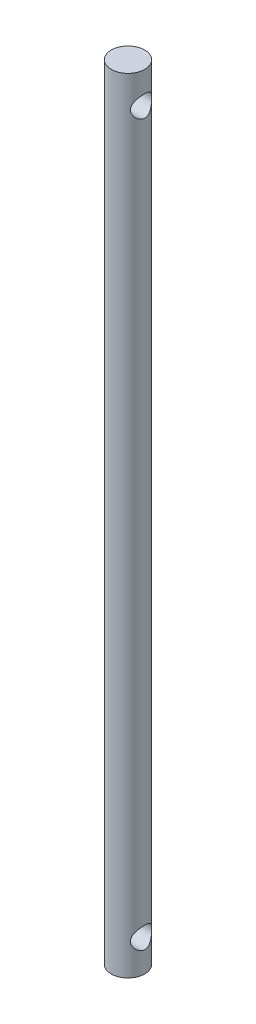
ISO-10303-21;
HEADER;
FILE_DESCRIPTION(('STEP AP214'),'2;1');
FILE_NAME('part.step','',(''),(''),'','','');
FILE_SCHEMA(('AUTOMOTIVE_DESIGN { 1 0 10303 214 1 1 1 1 }'));
ENDSEC;
DATA;
#1=APPLICATION_CONTEXT('core data for automotive mechanical design processes');
#2=APPLICATION_PROTOCOL_DEFINITION('international standard','automotive_design',2000,#1);
#3=PRODUCT_CONTEXT('',#1,'mechanical');
#4=PRODUCT('Part','Part','',(#3));
#5=PRODUCT_RELATED_PRODUCT_CATEGORY('part','',(#4));
#6=PRODUCT_DEFINITION_FORMATION('','',#4);
#7=PRODUCT_DEFINITION_CONTEXT('part definition',#1,'design');
#8=PRODUCT_DEFINITION('design','',#6,#7);
#9=PRODUCT_DEFINITION_SHAPE('','',#8);
#10=(LENGTH_UNIT() NAMED_UNIT(*) SI_UNIT(.MILLI.,.METRE.));
#11=(NAMED_UNIT(*) PLANE_ANGLE_UNIT() SI_UNIT($,.RADIAN.));
#12=(NAMED_UNIT(*) SI_UNIT($,.STERADIAN.) SOLID_ANGLE_UNIT());
#13=UNCERTAINTY_MEASURE_WITH_UNIT(LENGTH_MEASURE(1.E-05),#10,'distance_accuracy_value','');
#14=(GEOMETRIC_REPRESENTATION_CONTEXT(3) GLOBAL_UNCERTAINTY_ASSIGNED_CONTEXT((#13)) GLOBAL_UNIT_ASSIGNED_CONTEXT((#10,
#11,#12)) REPRESENTATION_CONTEXT('',''));
#15=CARTESIAN_POINT('',(0.,0.,0.));
#16=DIRECTION('',(0.,0.,1.));
#17=DIRECTION('',(1.,0.,0.));
#18=AXIS2_PLACEMENT_3D('',#15,#16,#17);
#19=CARTESIAN_POINT('',(0.,74.2,0.));
#20=DIRECTION('',(0.,-1.,0.));
#21=DIRECTION('',(0.,0.,-1.));
#22=AXIS2_PLACEMENT_3D('',#19,#20,#21);
#23=CYLINDRICAL_SURFACE('',#22,1.5875);
#24=CARTESIAN_POINT('',(0.,74.2,0.));
#25=DIRECTION('',(0.,1.,0.));
#26=DIRECTION('',(0.,0.,1.));
#27=AXIS2_PLACEMENT_3D('',#24,#25,#26);
#28=CIRCLE('',#27,1.5875);
#29=CARTESIAN_POINT('',(0.,74.2,1.5875));
#30=VERTEX_POINT('',#29);
#31=EDGE_CURVE('E10',#30,#30,#28,.T.);
#32=ORIENTED_EDGE('',*,*,#31,.F.);
#33=EDGE_LOOP('',(#32));
#34=FACE_BOUND('',#33,.T.);
#35=CARTESIAN_POINT('',(0.,0.,0.));
#36=DIRECTION('',(0.,1.,0.));
#37=DIRECTION('',(0.,0.,1.));
#38=AXIS2_PLACEMENT_3D('',#35,#36,#37);
#39=CIRCLE('',#38,1.5875);
#40=CARTESIAN_POINT('',(0.,0.,1.5875));
#41=VERTEX_POINT('',#40);
#42=EDGE_CURVE('E46',#41,#41,#39,.T.);
#43=ORIENTED_EDGE('',*,*,#42,.T.);
#44=EDGE_LOOP('',(#43));
#45=FACE_BOUND('',#44,.T.);
#46=CARTESIAN_POINT('',(-1.23294616670802,3.,-1.));
#47=CARTESIAN_POINT('',(-1.23295343516555,2.95040605894628,-0.999995450788771));
#48=CARTESIAN_POINT('',(-1.23599476553392,2.90073865570848,-0.996276820991358));
#49=CARTESIAN_POINT('',(-1.24762007388978,2.80308946717885,-0.981672190215802));
#50=CARTESIAN_POINT('',(-1.25621859525223,2.75511245411493,-0.970767381265045));
#51=CARTESIAN_POINT('',(-1.27750159901128,2.66255337582623,-0.942577089248306));
#52=CARTESIAN_POINT('',(-1.29015005760383,2.61794551172978,-0.925347672147624));
#53=CARTESIAN_POINT('',(-1.31804593880024,2.53231255327491,-0.885160169381446));
#54=CARTESIAN_POINT('',(-1.33329350325601,2.49128765464966,-0.862201771012428));
#55=CARTESIAN_POINT('',(-1.36717841732645,2.40782735768393,-0.80755655742477));
#56=CARTESIAN_POINT('',(-1.38599433243319,2.36596436599893,-0.775105940845026));
#57=CARTESIAN_POINT('',(-1.4234546139911,2.28778960224534,-0.703955121164063));
#58=CARTESIAN_POINT('',(-1.44209881591907,2.25148271988033,-0.665249474150722));
#59=CARTESIAN_POINT('',(-1.47983268144183,2.18101267196038,-0.576914644153927));
#60=CARTESIAN_POINT('',(-1.49869393502956,2.14766550137944,-0.526527063542523));
#61=CARTESIAN_POINT('',(-1.53210939312374,2.09019267280625,-0.419441332909715));
#62=CARTESIAN_POINT('',(-1.54666791761826,2.06605775845818,-0.362749591604796));
#63=CARTESIAN_POINT('',(-1.56848819043795,2.0303731811349,-0.2508182712836));
#64=CARTESIAN_POINT('',(-1.57634662158965,2.01778405291979,-0.196029531107031));
#65=CARTESIAN_POINT('',(-1.5862254234381,2.00200461132155,-0.0846180859015733));
#66=CARTESIAN_POINT('',(-1.58825206556806,1.99880420135563,-0.0279974172423706));
#67=CARTESIAN_POINT('',(-1.58637664878833,2.00178504802014,0.077127774592798));
#68=CARTESIAN_POINT('',(-1.58324482260059,2.00674735452726,0.125686917849281));
#69=CARTESIAN_POINT('',(-1.57275721210723,2.02355118508491,0.221121612795842));
#70=CARTESIAN_POINT('',(-1.56540110881232,2.03539322864818,0.267997037058601));
#71=CARTESIAN_POINT('',(-1.54707535722234,2.06542675091963,0.358992012097666));
#72=CARTESIAN_POINT('',(-1.53609896037726,2.08363009145363,0.403106231620515));
#73=CARTESIAN_POINT('',(-1.5113782042495,2.1257018576242,0.487684390492617));
#74=CARTESIAN_POINT('',(-1.49763323099248,2.14957154006911,0.528147517268848));
#75=CARTESIAN_POINT('',(-1.46647063044312,2.20565045384175,0.609718737977034));
#76=CARTESIAN_POINT('',(-1.44880860314281,2.23853001725953,0.650271796081865));
#77=CARTESIAN_POINT('',(-1.41257074941605,2.30996497218943,0.725639980152352));
#78=CARTESIAN_POINT('',(-1.3939936075441,2.34852870297865,0.760446513525202));
#79=CARTESIAN_POINT('',(-1.35505853820166,2.43628059139501,0.82806229486073));
#80=CARTESIAN_POINT('',(-1.33479399630552,2.48619982105452,0.859984453794868));
#81=CARTESIAN_POINT('',(-1.29779050456318,2.5919128699837,0.914874369188898));
#82=CARTESIAN_POINT('',(-1.2810451153584,2.64769567434934,0.937858547133176));
#83=CARTESIAN_POINT('',(-1.2576580890948,2.74846963209529,0.968878192275713));
#84=CARTESIAN_POINT('',(-1.24951383113858,2.79238661074527,0.979263428563033));
#85=CARTESIAN_POINT('',(-1.23781077291886,2.88179332851927,0.994018432885416));
#86=CARTESIAN_POINT('',(-1.23424551493005,2.92728075960789,0.998396673133275));
#87=CARTESIAN_POINT('',(-1.23223936193652,3.01865765319204,1.0008725324922));
#88=CARTESIAN_POINT('',(-1.23381126120984,3.06454783514584,0.998954470379171));
#89=CARTESIAN_POINT('',(-1.24185504791212,3.15522178074113,0.988934188800475));
#90=CARTESIAN_POINT('',(-1.24833101431722,3.20000459128555,0.980826821311367));
#91=CARTESIAN_POINT('',(-1.26508599284493,3.28645251151048,0.95911136357318));
#92=CARTESIAN_POINT('',(-1.27528696040964,3.32816186291804,0.945615660632211));
#93=CARTESIAN_POINT('',(-1.2983799314258,3.40881593069719,0.913648638370382));
#94=CARTESIAN_POINT('',(-1.31127288167388,3.44775966789987,0.895175567794949));
#95=CARTESIAN_POINT('',(-1.34128276198849,3.52972279603102,0.849701401494499));
#96=CARTESIAN_POINT('',(-1.35873537036811,3.57208849097894,0.821743837232918));
#97=CARTESIAN_POINT('',(-1.39426521672737,3.65199779267983,0.759904915323216));
#98=CARTESIAN_POINT('',(-1.41234309343434,3.68953627192481,0.726017347488664));
#99=CARTESIAN_POINT('',(-1.45062221949811,3.76510139323259,0.646607782896937));
#100=CARTESIAN_POINT('',(-1.47067526829378,3.80216686741315,0.600088041825319));
#101=CARTESIAN_POINT('',(-1.5075440293839,3.86791252700901,0.50029135707716));
#102=CARTESIAN_POINT('',(-1.52436110066351,3.89659623507745,0.447017265627681));
#103=CARTESIAN_POINT('',(-1.5520325227985,3.94285312491611,0.338118543571773));
#104=CARTESIAN_POINT('',(-1.56317017321604,3.96096266049447,0.282796968450699));
#105=CARTESIAN_POINT('',(-1.57951526260348,3.98733062800371,0.16903629413863));
#106=CARTESIAN_POINT('',(-1.58473122102871,3.9956032130322,0.110601800589335));
#107=CARTESIAN_POINT('',(-1.58828849387921,4.00125187468907,0.00185180002132479));
#108=CARTESIAN_POINT('',(-1.58754504841073,4.00007851712157,-0.0483642881855594));
#109=CARTESIAN_POINT('',(-1.58139125485789,3.99028132321764,-0.147767571117233));
#110=CARTESIAN_POINT('',(-1.57598118547954,3.98165793182153,-0.196954827107559));
#111=CARTESIAN_POINT('',(-1.56129574215027,3.95789916890513,-0.291022263425222));
#112=CARTESIAN_POINT('',(-1.55217820237086,3.94302896797061,-0.335995477101155));
#113=CARTESIAN_POINT('',(-1.53082586631383,3.9074545059972,-0.422760684784963));
#114=CARTESIAN_POINT('',(-1.51859056825152,3.88674930579293,-0.464552165304263));
#115=CARTESIAN_POINT('',(-1.49048602260074,3.83775670160764,-0.548414585166351));
#116=CARTESIAN_POINT('',(-1.47437290664722,3.80890984652313,-0.590075570709024));
#117=CARTESIAN_POINT('',(-1.44062624773879,3.74563030094768,-0.668258620877012));
#118=CARTESIAN_POINT('',(-1.42299102430624,3.71119139864632,-0.70477488536493));
#119=CARTESIAN_POINT('',(-1.38492539277423,3.63186248905108,-0.777203878766061));
#120=CARTESIAN_POINT('',(-1.36446544644953,3.58618032260803,-0.812237506597118));
#121=CARTESIAN_POINT('',(-1.32557337836773,3.48884706574958,-0.874272534854812));
#122=CARTESIAN_POINT('',(-1.30714027626589,3.43719888598667,-0.901277829293189));
#123=CARTESIAN_POINT('',(-1.2784821489388,3.3405844087489,-0.941333576694137));
#124=CARTESIAN_POINT('',(-1.26734374168865,3.29661940064701,-0.956143253644517));
#125=CARTESIAN_POINT('',(-1.24931196890479,3.20630313726921,-0.979591490950994));
#126=CARTESIAN_POINT('',(-1.24240541815797,3.1599597863558,-0.98824923251962));
#127=CARTESIAN_POINT('',(-1.2364078830632,3.09433686298155,-0.995719546895077));
#128=CARTESIAN_POINT('',(-1.23511444324237,3.07553398411047,-0.997321827045291));
#129=CARTESIAN_POINT('',(-1.23338208515551,3.03782431733413,-0.99946306264957));
#130=CARTESIAN_POINT('',(-1.23294339417038,3.01891750313194,-1.00000173528693));
#131=CARTESIAN_POINT('',(-1.23294616670802,3.,-1.));
#132=B_SPLINE_CURVE_WITH_KNOTS('',3,(#46,#47,#48,#49,#50,#51,#52,#53,#54,#55,#56,#57,#58,#59,
#60,#61,#62,#63,#64,#65,#66,#67,#68,#69,#70,#71,#72,#73,#74,#75,#76,#77,#78,#79,#80,#81,#82,#83,
#84,#85,#86,#87,#88,#89,#90,#91,#92,#93,#94,#95,#96,#97,#98,#99,#100,#101,#102,#103,#104,#105,
#106,#107,#108,#109,#110,#111,#112,#113,#114,#115,#116,#117,#118,#119,#120,#121,#122,#123,#124,
#125,#126,#127,#128,#129,#130,#131),.UNSPECIFIED.,.T.,.F.,(4,2,2,2,2,2,2,2,2,2,2,2,2,2,2,2,2,2,
2,2,2,2,2,2,2,2,2,2,2,2,2,2,2,2,2,2,2,2,2,2,2,2,4),(0.,0.148695031605983,0.297780788060276,
0.445575654423313,0.593378589601049,0.761364983433111,0.929498375367124,1.11835814682833,
1.3070276517431,1.4762832319646,1.64535672869878,1.79139176282175,1.93743782598874,
2.08375768538431,2.23011002925186,2.39480918965614,2.55975243167797,2.74671735954944,
2.93333714087415,3.07033794882618,3.20714533275859,3.34429369988828,3.48155626614919,
3.61609408852331,3.75067930911262,3.91111230808139,4.07171433686855,4.25908060316168,
4.44636801032367,4.62306952225304,4.79951649275447,4.9494497980362,5.09937414943117,
5.24349137949947,5.3876318190466,5.54653841773157,5.70562275753819,5.88811074638117,
6.07051007745609,6.21310708865827,6.35525752004378,6.41196184714984,6.46868125009187),.UNSPECIFIED.);
#133=CARTESIAN_POINT('',(-1.23294616670802,3.,-1.));
#134=VERTEX_POINT('',#133);
#135=EDGE_CURVE('E57',#134,#134,#132,.T.);
#136=ORIENTED_EDGE('',*,*,#135,.F.);
#137=EDGE_LOOP('',(#136));
#138=FACE_BOUND('',#137,.T.);
#139=CARTESIAN_POINT('',(1.23294616670802,3.,1.));
#140=CARTESIAN_POINT('',(1.23295343516555,3.04959394105372,0.999995450788771));
#141=CARTESIAN_POINT('',(1.23599476553393,3.09926134429153,0.996276820991357));
#142=CARTESIAN_POINT('',(1.24762007388978,3.19691053282116,0.981672190215801));
#143=CARTESIAN_POINT('',(1.25621859525223,3.24488754588508,0.970767381265044));
#144=CARTESIAN_POINT('',(1.27750159901128,3.33744662417378,0.942577089248306));
#145=CARTESIAN_POINT('',(1.29015005760384,3.38205448827023,0.925347672147623));
#146=CARTESIAN_POINT('',(1.31804593880024,3.46768744672509,0.885160169381445));
#147=CARTESIAN_POINT('',(1.33329350325602,3.50871234535035,0.862201771012427));
#148=CARTESIAN_POINT('',(1.36717841732645,3.59217264231608,0.807556557424769));
#149=CARTESIAN_POINT('',(1.38599433243319,3.63403563400108,0.775105940845025));
#150=CARTESIAN_POINT('',(1.4234546139911,3.71221039775467,0.703955121164063));
#151=CARTESIAN_POINT('',(1.44209881591907,3.74851728011967,0.665249474150721));
#152=CARTESIAN_POINT('',(1.47983268144183,3.81898732803963,0.576914644153926));
#153=CARTESIAN_POINT('',(1.49869393502956,3.85233449862056,0.526527063542522));
#154=CARTESIAN_POINT('',(1.53210939312374,3.90980732719376,0.419441332909714));
#155=CARTESIAN_POINT('',(1.54666791761826,3.93394224154182,0.362749591604794));
#156=CARTESIAN_POINT('',(1.56848819043795,3.96962681886511,0.250818271283599));
#157=CARTESIAN_POINT('',(1.57634662158965,3.98221594708021,0.19602953110703));
#158=CARTESIAN_POINT('',(1.5862254234381,3.99799538867846,0.0846180859015723));
#159=CARTESIAN_POINT('',(1.58825206556806,4.00119579864438,0.0279974172423696));
#160=CARTESIAN_POINT('',(1.58637664878833,3.99821495197986,-0.0771277745927989));
#161=CARTESIAN_POINT('',(1.58324482260059,3.99325264547275,-0.125686917849282));
#162=CARTESIAN_POINT('',(1.57275721210723,3.97644881491509,-0.221121612795842));
#163=CARTESIAN_POINT('',(1.56540110881232,3.96460677135183,-0.267997037058602));
#164=CARTESIAN_POINT('',(1.54707535722233,3.93457324908038,-0.358992012097666));
#165=CARTESIAN_POINT('',(1.53609896037726,3.91636990854638,-0.403106231620516));
#166=CARTESIAN_POINT('',(1.5113782042495,3.87429814237581,-0.487684390492618));
#167=CARTESIAN_POINT('',(1.49763323099248,3.8504284599309,-0.528147517268849));
#168=CARTESIAN_POINT('',(1.46647063044312,3.79434954615826,-0.609718737977035));
#169=CARTESIAN_POINT('',(1.44880860314281,3.76146998274047,-0.650271796081866));
#170=CARTESIAN_POINT('',(1.41257074941605,3.69003502781057,-0.725639980152353));
#171=CARTESIAN_POINT('',(1.3939936075441,3.65147129702136,-0.760446513525203));
#172=CARTESIAN_POINT('',(1.35505853820166,3.563719408605,-0.828062294860731));
#173=CARTESIAN_POINT('',(1.33479399630552,3.51380017894549,-0.859984453794869));
#174=CARTESIAN_POINT('',(1.29779050456318,3.4080871300163,-0.914874369188899));
#175=CARTESIAN_POINT('',(1.2810451153584,3.35230432565067,-0.937858547133177));
#176=CARTESIAN_POINT('',(1.2576580890948,3.25153036790471,-0.968878192275714));
#177=CARTESIAN_POINT('',(1.24951383113858,3.20761338925473,-0.979263428563034));
#178=CARTESIAN_POINT('',(1.23781077291886,3.11820667148073,-0.994018432885418));
#179=CARTESIAN_POINT('',(1.23424551493005,3.07271924039212,-0.998396673133276));
#180=CARTESIAN_POINT('',(1.23223936193652,2.98134234680797,-1.0008725324922));
#181=CARTESIAN_POINT('',(1.23381126120984,2.93545216485417,-0.998954470379172));
#182=CARTESIAN_POINT('',(1.24185504791212,2.84477821925887,-0.988934188800476));
#183=CARTESIAN_POINT('',(1.24833101431722,2.79999540871446,-0.980826821311368));
#184=CARTESIAN_POINT('',(1.26508599284493,2.71354748848953,-0.95911136357318));
#185=CARTESIAN_POINT('',(1.27528696040963,2.67183813708197,-0.945615660632211));
#186=CARTESIAN_POINT('',(1.2983799314258,2.59118406930281,-0.913648638370383));
#187=CARTESIAN_POINT('',(1.31127288167388,2.55224033210014,-0.89517556779495));
#188=CARTESIAN_POINT('',(1.34128276198849,2.47027720396899,-0.849701401494499));
#189=CARTESIAN_POINT('',(1.35873537036811,2.42791150902107,-0.821743837232918));
#190=CARTESIAN_POINT('',(1.39426521672737,2.34800220732017,-0.759904915323216));
#191=CARTESIAN_POINT('',(1.41234309343434,2.31046372807519,-0.726017347488665));
#192=CARTESIAN_POINT('',(1.45062221949811,2.23489860676742,-0.646607782896937));
#193=CARTESIAN_POINT('',(1.47067526829378,2.19783313258685,-0.60008804182532));
#194=CARTESIAN_POINT('',(1.5075440293839,2.132087472991,-0.500291357077161));
#195=CARTESIAN_POINT('',(1.52436110066351,2.10340376492255,-0.447017265627682));
#196=CARTESIAN_POINT('',(1.5520325227985,2.0571468750839,-0.338118543571773));
#197=CARTESIAN_POINT('',(1.56317017321604,2.03903733950554,-0.282796968450699));
#198=CARTESIAN_POINT('',(1.57951526260348,2.0126693719963,-0.169036294138631));
#199=CARTESIAN_POINT('',(1.58473122102871,2.00439678696781,-0.110601800589335));
#200=CARTESIAN_POINT('',(1.58828849387921,1.99874812531093,-0.00185180002132503));
#201=CARTESIAN_POINT('',(1.58754504841073,1.99992148287844,0.0483642881855592));
#202=CARTESIAN_POINT('',(1.58139125485789,2.00971867678236,0.147767571117233));
#203=CARTESIAN_POINT('',(1.57598118547954,2.01834206817848,0.196954827107559));
#204=CARTESIAN_POINT('',(1.56129574215027,2.04210083109487,0.291022263425221));
#205=CARTESIAN_POINT('',(1.55217820237086,2.05697103202939,0.335995477101155));
#206=CARTESIAN_POINT('',(1.53082586631383,2.09254549400281,0.422760684784962));
#207=CARTESIAN_POINT('',(1.51859056825152,2.11325069420707,0.464552165304263));
#208=CARTESIAN_POINT('',(1.49048602260074,2.16224329839237,0.548414585166351));
#209=CARTESIAN_POINT('',(1.47437290664722,2.19109015347687,0.590075570709023));
#210=CARTESIAN_POINT('',(1.44062624773879,2.25436969905233,0.668258620877012));
#211=CARTESIAN_POINT('',(1.42299102430624,2.28880860135369,0.70477488536493));
#212=CARTESIAN_POINT('',(1.38492539277423,2.36813751094892,0.77720387876606));
#213=CARTESIAN_POINT('',(1.36446544644953,2.41381967739197,0.812237506597117));
#214=CARTESIAN_POINT('',(1.32557337836774,2.51115293425043,0.874272534854811));
#215=CARTESIAN_POINT('',(1.30714027626589,2.56280111401334,0.901277829293188));
#216=CARTESIAN_POINT('',(1.2784821489388,2.65941559125111,0.941333576694137));
#217=CARTESIAN_POINT('',(1.26734374168865,2.70338059935299,0.956143253644516));
#218=CARTESIAN_POINT('',(1.24931196890479,2.7936968627308,0.979591490950992));
#219=CARTESIAN_POINT('',(1.24240541815797,2.8400402136442,0.988249232519619));
#220=CARTESIAN_POINT('',(1.2364078830632,2.90566313701846,0.995719546895076));
#221=CARTESIAN_POINT('',(1.23511444324237,2.92446601588954,0.99732182704529));
#222=CARTESIAN_POINT('',(1.23338208515551,2.96217568266587,0.999463062649569));
#223=CARTESIAN_POINT('',(1.23294339417038,2.98108249686807,1.00000173528693));
#224=CARTESIAN_POINT('',(1.23294616670802,3.,1.));
#225=B_SPLINE_CURVE_WITH_KNOTS('',3,(#139,#140,#141,#142,#143,#144,#145,#146,#147,#148,#149,
#150,#151,#152,#153,#154,#155,#156,#157,#158,#159,#160,#161,#162,#163,#164,#165,#166,#167,#168,
#169,#170,#171,#172,#173,#174,#175,#176,#177,#178,#179,#180,#181,#182,#183,#184,#185,#186,#187,
#188,#189,#190,#191,#192,#193,#194,#195,#196,#197,#198,#199,#200,#201,#202,#203,#204,#205,#206,
#207,#208,#209,#210,#211,#212,#213,#214,#215,#216,#217,#218,#219,#220,#221,#222,#223,#224),
.UNSPECIFIED.,.T.,.F.,(4,2,2,2,2,2,2,2,2,2,2,2,2,2,2,2,2,2,2,2,2,2,2,2,2,2,2,2,2,2,2,2,2,2,2,2,
2,2,2,2,2,2,4),(0.,0.148695031605983,0.297780788060276,0.445575654423313,0.593378589601049,
0.761364983433112,0.929498375367124,1.11835814682833,1.3070276517431,1.4762832319646,
1.64535672869878,1.79139176282174,1.93743782598874,2.08375768538431,2.23011002925186,
2.39480918965614,2.55975243167797,2.74671735954944,2.93333714087416,3.07033794882618,
3.2071453327586,3.34429369988828,3.48155626614919,3.61609408852331,3.75067930911262,
3.91111230808139,4.07171433686855,4.25908060316168,4.44636801032367,4.62306952225304,
4.79951649275447,4.94944979803621,5.09937414943117,5.24349137949947,5.3876318190466,
5.54653841773157,5.70562275753819,5.88811074638117,6.07051007745609,6.21310708865827,
6.35525752004378,6.41196184714984,6.46868125009187),.UNSPECIFIED.);
#226=CARTESIAN_POINT('',(1.23294616670802,3.,1.));
#227=VERTEX_POINT('',#226);
#228=EDGE_CURVE('E67',#227,#227,#225,.T.);
#229=ORIENTED_EDGE('',*,*,#228,.T.);
#230=EDGE_LOOP('',(#229));
#231=FACE_BOUND('',#230,.T.);
#232=CARTESIAN_POINT('',(-1.23294616670802,71.2,-1.));
#233=CARTESIAN_POINT('',(-1.23295343516555,71.1504060589463,-0.999995450788772));
#234=CARTESIAN_POINT('',(-1.23599476553392,71.1007386557085,-0.996276820991358));
#235=CARTESIAN_POINT('',(-1.24762007388978,71.0030894671788,-0.981672190215802));
#236=CARTESIAN_POINT('',(-1.25621859525223,70.9551124541149,-0.970767381265045));
#237=CARTESIAN_POINT('',(-1.27750159901128,70.8625533758262,-0.942577089248304));
#238=CARTESIAN_POINT('',(-1.29015005760384,70.8179455117298,-0.925347672147619));
#239=CARTESIAN_POINT('',(-1.31804593880024,70.7323125532749,-0.885160169381439));
#240=CARTESIAN_POINT('',(-1.33329350325602,70.6912876546496,-0.862201771012423));
#241=CARTESIAN_POINT('',(-1.36717841732645,70.6078273576839,-0.807556557424765));
#242=CARTESIAN_POINT('',(-1.38599433243319,70.5659643659989,-0.775105940845019));
#243=CARTESIAN_POINT('',(-1.4234546139911,70.4877896022453,-0.703955121164054));
#244=CARTESIAN_POINT('',(-1.44209881591908,70.4514827198803,-0.665249474150712));
#245=CARTESIAN_POINT('',(-1.47983268144183,70.3810126719604,-0.57691464415392));
#246=CARTESIAN_POINT('',(-1.49869393502956,70.3476655013794,-0.526527063542521));
#247=CARTESIAN_POINT('',(-1.53210939312374,70.2901926728062,-0.419441332909715));
#248=CARTESIAN_POINT('',(-1.54666791761826,70.2660577584582,-0.362749591604794));
#249=CARTESIAN_POINT('',(-1.56848819043795,70.2303731811349,-0.250818271283598));
#250=CARTESIAN_POINT('',(-1.57634662158965,70.2177840529198,-0.196029531107031));
#251=CARTESIAN_POINT('',(-1.5862254234381,70.2020046113215,-0.0846180859015726));
#252=CARTESIAN_POINT('',(-1.58825206556806,70.1988042013556,-0.027997417242369));
#253=CARTESIAN_POINT('',(-1.58637664878833,70.2017850480201,0.0771277745928001));
#254=CARTESIAN_POINT('',(-1.58324482260059,70.2067473545273,0.125686917849283));
#255=CARTESIAN_POINT('',(-1.57275721210723,70.2235511850849,0.221121612795844));
#256=CARTESIAN_POINT('',(-1.56540110881232,70.2353932286482,0.267997037058603));
#257=CARTESIAN_POINT('',(-1.54707535722233,70.2654267509196,0.35899201209767));
#258=CARTESIAN_POINT('',(-1.53609896037726,70.2836300914536,0.40310623162052));
#259=CARTESIAN_POINT('',(-1.5113782042495,70.3257018576242,0.487684390492623));
#260=CARTESIAN_POINT('',(-1.49763323099247,70.3495715400691,0.528147517268854));
#261=CARTESIAN_POINT('',(-1.46647063044312,70.4056504538418,0.609718737977039));
#262=CARTESIAN_POINT('',(-1.44880860314281,70.4385300172595,0.650271796081869));
#263=CARTESIAN_POINT('',(-1.41257074941605,70.5099649721894,0.725639980152355));
#264=CARTESIAN_POINT('',(-1.3939936075441,70.5485287029786,0.760446513525205));
#265=CARTESIAN_POINT('',(-1.35505853820166,70.636280591395,0.828062294860731));
#266=CARTESIAN_POINT('',(-1.33479399630552,70.6861998210545,0.859984453794867));
#267=CARTESIAN_POINT('',(-1.29779050456318,70.7919128699837,0.914874369188897));
#268=CARTESIAN_POINT('',(-1.2810451153584,70.8476956743493,0.937858547133176));
#269=CARTESIAN_POINT('',(-1.2576580890948,70.9484696320953,0.968878192275716));
#270=CARTESIAN_POINT('',(-1.24951383113858,70.9923866107453,0.979263428563037));
#271=CARTESIAN_POINT('',(-1.23781077291886,71.0817933285193,0.994018432885419));
#272=CARTESIAN_POINT('',(-1.23424551493005,71.1272807596079,0.998396673133277));
#273=CARTESIAN_POINT('',(-1.23223936193652,71.2186576531921,1.0008725324922));
#274=CARTESIAN_POINT('',(-1.23381126120984,71.2645478351458,0.998954470379171));
#275=CARTESIAN_POINT('',(-1.24185504791212,71.3552217807411,0.988934188800472));
#276=CARTESIAN_POINT('',(-1.24833101431723,71.4000045912856,0.980826821311363));
#277=CARTESIAN_POINT('',(-1.26508599284493,71.4864525115105,0.959111363573173));
#278=CARTESIAN_POINT('',(-1.27528696040964,71.5281618629181,0.945615660632204));
#279=CARTESIAN_POINT('',(-1.2983799314258,71.6088159306972,0.913648638370374));
#280=CARTESIAN_POINT('',(-1.31127288167388,71.6477596678999,0.895175567794941));
#281=CARTESIAN_POINT('',(-1.3412827619885,71.729722796031,0.84970140149449));
#282=CARTESIAN_POINT('',(-1.35873537036812,71.7720884909789,0.821743837232908));
#283=CARTESIAN_POINT('',(-1.39426521672738,71.8519977926799,0.7599049153232));
#284=CARTESIAN_POINT('',(-1.41234309343435,71.8895362719248,0.726017347488643));
#285=CARTESIAN_POINT('',(-1.45062221949812,71.9651013932326,0.646607782896912));
#286=CARTESIAN_POINT('',(-1.47067526829379,72.0021668674132,0.600088041825297));
#287=CARTESIAN_POINT('',(-1.50754402938391,72.067912527009,0.500291357077136));
#288=CARTESIAN_POINT('',(-1.52436110066352,72.0965962350775,0.447017265627654));
#289=CARTESIAN_POINT('',(-1.55203252279851,72.1428531249161,0.338118543571743));
#290=CARTESIAN_POINT('',(-1.56317017321604,72.1609626604945,0.282796968450669));
#291=CARTESIAN_POINT('',(-1.57951526260349,72.1873306280037,0.169036294138602));
#292=CARTESIAN_POINT('',(-1.58473122102871,72.1956032130322,0.110601800589306));
#293=CARTESIAN_POINT('',(-1.58828849387921,72.2012518746891,0.00185180002129709));
#294=CARTESIAN_POINT('',(-1.58754504841073,72.2000785171216,-0.0483642881855857));
#295=CARTESIAN_POINT('',(-1.58139125485788,72.1902813232176,-0.147767571117258));
#296=CARTESIAN_POINT('',(-1.57598118547954,72.1816579318215,-0.196954827107584));
#297=CARTESIAN_POINT('',(-1.56129574215027,72.1578991689051,-0.291022263425245));
#298=CARTESIAN_POINT('',(-1.55217820237086,72.1430289679706,-0.335995477101176));
#299=CARTESIAN_POINT('',(-1.53082586631382,72.1074545059972,-0.422760684784983));
#300=CARTESIAN_POINT('',(-1.51859056825151,72.0867493057929,-0.464552165304285));
#301=CARTESIAN_POINT('',(-1.49048602260073,72.0377567016076,-0.548414585166372));
#302=CARTESIAN_POINT('',(-1.47437290664721,72.0089098465231,-0.59007557070904));
#303=CARTESIAN_POINT('',(-1.44062624773878,71.9456303009477,-0.668258620877028));
#304=CARTESIAN_POINT('',(-1.42299102430623,71.9111913986463,-0.704774885364949));
#305=CARTESIAN_POINT('',(-1.38492539277422,71.8318624890511,-0.77720387876608));
#306=CARTESIAN_POINT('',(-1.36446544644952,71.786180322608,-0.812237506597133));
#307=CARTESIAN_POINT('',(-1.32557337836773,71.6888470657495,-0.874272534854824));
#308=CARTESIAN_POINT('',(-1.30714027626588,71.6371988859866,-0.901277829293203));
#309=CARTESIAN_POINT('',(-1.27848214893879,71.5405844087489,-0.941333576694148));
#310=CARTESIAN_POINT('',(-1.26734374168865,71.496619400647,-0.956143253644524));
#311=CARTESIAN_POINT('',(-1.24931196890479,71.4063031372692,-0.979591490950997));
#312=CARTESIAN_POINT('',(-1.24240541815797,71.3599597863558,-0.988249232519623));
#313=CARTESIAN_POINT('',(-1.2364078830632,71.2943368629815,-0.995719546895079));
#314=CARTESIAN_POINT('',(-1.23511444324237,71.2755339841105,-0.997321827045292));
#315=CARTESIAN_POINT('',(-1.23338208515551,71.2378243173341,-0.999463062649571));
#316=CARTESIAN_POINT('',(-1.23294339417038,71.2189175031319,-1.00000173528693));
#317=CARTESIAN_POINT('',(-1.23294616670802,71.2,-1.));
#318=B_SPLINE_CURVE_WITH_KNOTS('',3,(#232,#233,#234,#235,#236,#237,#238,#239,#240,#241,#242,
#243,#244,#245,#246,#247,#248,#249,#250,#251,#252,#253,#254,#255,#256,#257,#258,#259,#260,#261,
#262,#263,#264,#265,#266,#267,#268,#269,#270,#271,#272,#273,#274,#275,#276,#277,#278,#279,#280,
#281,#282,#283,#284,#285,#286,#287,#288,#289,#290,#291,#292,#293,#294,#295,#296,#297,#298,#299,
#300,#301,#302,#303,#304,#305,#306,#307,#308,#309,#310,#311,#312,#313,#314,#315,#316,#317),
.UNSPECIFIED.,.T.,.F.,(4,2,2,2,2,2,2,2,2,2,2,2,2,2,2,2,2,2,2,2,2,2,2,2,2,2,2,2,2,2,2,2,2,2,2,2,
2,2,2,2,2,2,4),(0.,0.148695031605987,0.297780788060281,0.445575654423335,0.593378589601066,
0.761364983433126,0.929498375367136,1.11835814682834,1.3070276517431,1.4762832319646,
1.64535672869878,1.79139176282175,1.93743782598874,2.08375768538432,2.23011002925187,
2.39480918965615,2.55975243167797,2.74671735954944,2.93333714087416,3.0703379488262,
3.20714533275861,3.34429369988831,3.48155626614922,3.61609408852335,3.75067930911264,
3.91111230808142,4.07171433686859,4.25908060316172,4.44636801032371,4.62306952225308,
4.79951649275451,4.94944979803624,5.0993741494312,5.2434913794995,5.38763181904663,
5.5465384177316,5.70562275753822,5.88811074638121,6.07051007745613,6.2131070886583,
6.3552575200438,6.41196184714985,6.46868125009188),.UNSPECIFIED.);
#319=CARTESIAN_POINT('',(-1.23294616670802,71.2,-1.));
#320=VERTEX_POINT('',#319);
#321=EDGE_CURVE('E66',#320,#320,#318,.T.);
#322=ORIENTED_EDGE('',*,*,#321,.F.);
#323=EDGE_LOOP('',(#322));
#324=FACE_BOUND('',#323,.T.);
#325=CARTESIAN_POINT('',(1.23294616670802,71.2,1.));
#326=CARTESIAN_POINT('',(1.23295343516555,71.2495939410537,0.999995450788772));
#327=CARTESIAN_POINT('',(1.23599476553392,71.2992613442915,0.996276820991358));
#328=CARTESIAN_POINT('',(1.24762007388978,71.3969105328212,0.981672190215801));
#329=CARTESIAN_POINT('',(1.25621859525223,71.4448875458851,0.970767381265044));
#330=CARTESIAN_POINT('',(1.27750159901128,71.5374466241738,0.942577089248303));
#331=CARTESIAN_POINT('',(1.29015005760384,71.5820544882702,0.925347672147618));
#332=CARTESIAN_POINT('',(1.31804593880024,71.6676874467251,0.885160169381439));
#333=CARTESIAN_POINT('',(1.33329350325602,71.7087123453504,0.862201771012422));
#334=CARTESIAN_POINT('',(1.36717841732645,71.7921726423161,0.807556557424764));
#335=CARTESIAN_POINT('',(1.38599433243319,71.8340356340011,0.775105940845018));
#336=CARTESIAN_POINT('',(1.4234546139911,71.9122103977547,0.703955121164053));
#337=CARTESIAN_POINT('',(1.44209881591908,71.9485172801197,0.665249474150711));
#338=CARTESIAN_POINT('',(1.47983268144183,72.0189873280396,0.57691464415392));
#339=CARTESIAN_POINT('',(1.49869393502956,72.0523344986206,0.52652706354252));
#340=CARTESIAN_POINT('',(1.53210939312374,72.1098073271937,0.419441332909714));
#341=CARTESIAN_POINT('',(1.54666791761826,72.1339422415418,0.362749591604793));
#342=CARTESIAN_POINT('',(1.56848819043795,72.1696268188651,0.250818271283598));
#343=CARTESIAN_POINT('',(1.57634662158965,72.1822159470802,0.19602953110703));
#344=CARTESIAN_POINT('',(1.5862254234381,72.1979953886785,0.0846180859015721));
#345=CARTESIAN_POINT('',(1.58825206556806,72.2011957986444,0.0279974172423685));
#346=CARTESIAN_POINT('',(1.58637664878833,72.1982149519799,-0.0771277745927998));
#347=CARTESIAN_POINT('',(1.58324482260059,72.1932526454727,-0.125686917849282));
#348=CARTESIAN_POINT('',(1.57275721210723,72.1764488149151,-0.221121612795843));
#349=CARTESIAN_POINT('',(1.56540110881232,72.1646067713518,-0.267997037058603));
#350=CARTESIAN_POINT('',(1.54707535722233,72.1345732490804,-0.35899201209767));
#351=CARTESIAN_POINT('',(1.53609896037726,72.1163699085464,-0.403106231620521));
#352=CARTESIAN_POINT('',(1.5113782042495,72.0742981423758,-0.487684390492623));
#353=CARTESIAN_POINT('',(1.49763323099247,72.0504284599309,-0.528147517268855));
#354=CARTESIAN_POINT('',(1.46647063044312,71.9943495461582,-0.60971873797704));
#355=CARTESIAN_POINT('',(1.44880860314281,71.9614699827405,-0.650271796081869));
#356=CARTESIAN_POINT('',(1.41257074941605,71.8900350278106,-0.725639980152355));
#357=CARTESIAN_POINT('',(1.3939936075441,71.8514712970213,-0.760446513525205));
#358=CARTESIAN_POINT('',(1.35505853820166,71.763719408605,-0.828062294860731));
#359=CARTESIAN_POINT('',(1.33479399630552,71.7138001789455,-0.859984453794868));
#360=CARTESIAN_POINT('',(1.29779050456318,71.6080871300163,-0.914874369188898));
#361=CARTESIAN_POINT('',(1.2810451153584,71.5523043256507,-0.937858547133177));
#362=CARTESIAN_POINT('',(1.2576580890948,71.4515303679047,-0.968878192275717));
#363=CARTESIAN_POINT('',(1.24951383113858,71.4076133892547,-0.979263428563038));
#364=CARTESIAN_POINT('',(1.23781077291886,71.3182066714807,-0.99401843288542));
#365=CARTESIAN_POINT('',(1.23424551493005,71.2727192403921,-0.998396673133278));
#366=CARTESIAN_POINT('',(1.23223936193652,71.181342346808,-1.0008725324922));
#367=CARTESIAN_POINT('',(1.23381126120984,71.1354521648541,-0.998954470379172));
#368=CARTESIAN_POINT('',(1.24185504791212,71.0447782192588,-0.988934188800473));
#369=CARTESIAN_POINT('',(1.24833101431723,70.9999954087144,-0.980826821311364));
#370=CARTESIAN_POINT('',(1.26508599284493,70.9135474884895,-0.959111363573174));
#371=CARTESIAN_POINT('',(1.27528696040964,70.8718381370819,-0.945615660632205));
#372=CARTESIAN_POINT('',(1.2983799314258,70.7911840693028,-0.913648638370375));
#373=CARTESIAN_POINT('',(1.31127288167388,70.7522403321001,-0.895175567794942));
#374=CARTESIAN_POINT('',(1.3412827619885,70.670277203969,-0.849701401494491));
#375=CARTESIAN_POINT('',(1.35873537036812,70.627911509021,-0.821743837232909));
#376=CARTESIAN_POINT('',(1.39426521672738,70.5480022073202,-0.759904915323201));
#377=CARTESIAN_POINT('',(1.41234309343435,70.5104637280752,-0.726017347488644));
#378=CARTESIAN_POINT('',(1.45062221949812,70.4348986067674,-0.646607782896913));
#379=CARTESIAN_POINT('',(1.47067526829379,70.3978331325868,-0.600088041825298));
#380=CARTESIAN_POINT('',(1.50754402938391,70.332087472991,-0.500291357077138));
#381=CARTESIAN_POINT('',(1.52436110066352,70.3034037649225,-0.447017265627655));
#382=CARTESIAN_POINT('',(1.55203252279851,70.2571468750839,-0.338118543571743));
#383=CARTESIAN_POINT('',(1.56317017321604,70.2390373395055,-0.28279696845067));
#384=CARTESIAN_POINT('',(1.57951526260349,70.2126693719963,-0.169036294138603));
#385=CARTESIAN_POINT('',(1.58473122102871,70.2043967869678,-0.110601800589307));
#386=CARTESIAN_POINT('',(1.58828849387921,70.1987481253109,-0.00185180002129856));
#387=CARTESIAN_POINT('',(1.58754504841073,70.1999214828784,0.0483642881855846));
#388=CARTESIAN_POINT('',(1.58139125485788,70.2097186767824,0.147767571117257));
#389=CARTESIAN_POINT('',(1.57598118547954,70.2183420681785,0.196954827107582));
#390=CARTESIAN_POINT('',(1.56129574215027,70.2421008310949,0.291022263425246));
#391=CARTESIAN_POINT('',(1.55217820237086,70.2569710320294,0.335995477101181));
#392=CARTESIAN_POINT('',(1.53082586631382,70.2925454940028,0.422760684784988));
#393=CARTESIAN_POINT('',(1.51859056825151,70.3132506942071,0.464552165304287));
#394=CARTESIAN_POINT('',(1.49048602260073,70.3622432983924,0.54841458516637));
#395=CARTESIAN_POINT('',(1.47437290664722,70.3910901534769,0.590075570709039));
#396=CARTESIAN_POINT('',(1.44062624773878,70.4543696990524,0.668258620877027));
#397=CARTESIAN_POINT('',(1.42299102430624,70.4888086013537,0.704774885364948));
#398=CARTESIAN_POINT('',(1.38492539277422,70.5681375109489,0.777203878766079));
#399=CARTESIAN_POINT('',(1.36446544644952,70.613819677392,0.812237506597132));
#400=CARTESIAN_POINT('',(1.32557337836773,70.7111529342504,0.874272534854823));
#401=CARTESIAN_POINT('',(1.30714027626588,70.7628011140134,0.901277829293202));
#402=CARTESIAN_POINT('',(1.27848214893879,70.8594155912511,0.941333576694149));
#403=CARTESIAN_POINT('',(1.26734374168864,70.903380599353,0.956143253644526));
#404=CARTESIAN_POINT('',(1.24931196890479,70.9936968627308,0.979591490950998));
#405=CARTESIAN_POINT('',(1.24240541815797,71.0400402136442,0.988249232519623));
#406=CARTESIAN_POINT('',(1.2364078830632,71.1056631370185,0.995719546895078));
#407=CARTESIAN_POINT('',(1.23511444324237,71.1244660158895,0.997321827045292));
#408=CARTESIAN_POINT('',(1.23338208515551,71.1621756826659,0.99946306264957));
#409=CARTESIAN_POINT('',(1.23294339417038,71.1810824968681,1.00000173528693));
#410=CARTESIAN_POINT('',(1.23294616670802,71.2,1.));
#411=B_SPLINE_CURVE_WITH_KNOTS('',3,(#325,#326,#327,#328,#329,#330,#331,#332,#333,#334,#335,
#336,#337,#338,#339,#340,#341,#342,#343,#344,#345,#346,#347,#348,#349,#350,#351,#352,#353,#354,
#355,#356,#357,#358,#359,#360,#361,#362,#363,#364,#365,#366,#367,#368,#369,#370,#371,#372,#373,
#374,#375,#376,#377,#378,#379,#380,#381,#382,#383,#384,#385,#386,#387,#388,#389,#390,#391,#392,
#393,#394,#395,#396,#397,#398,#399,#400,#401,#402,#403,#404,#405,#406,#407,#408,#409,#410),
.UNSPECIFIED.,.T.,.F.,(4,2,2,2,2,2,2,2,2,2,2,2,2,2,2,2,2,2,2,2,2,2,2,2,2,2,2,2,2,2,2,2,2,2,2,2,
2,2,2,2,2,2,4),(0.,0.148695031605987,0.297780788060281,0.445575654423335,0.593378589601066,
0.761364983433126,0.929498375367136,1.11835814682834,1.3070276517431,1.4762832319646,
1.64535672869878,1.79139176282175,1.93743782598874,2.08375768538432,2.23011002925187,
2.39480918965615,2.55975243167797,2.74671735954944,2.93333714087416,3.0703379488262,
3.20714533275861,3.34429369988831,3.48155626614922,3.61609408852334,3.75067930911264,
3.91111230808142,4.07171433686859,4.25908060316172,4.44636801032371,4.62306952225307,
4.79951649275451,4.94944979803623,5.0993741494312,5.2434913794995,5.38763181904662,
5.5465384177316,5.70562275753822,5.88811074638121,6.07051007745613,6.21310708865831,
6.3552575200438,6.41196184714985,6.46868125009187),.UNSPECIFIED.);
#412=CARTESIAN_POINT('',(1.23294616670802,71.2,1.));
#413=VERTEX_POINT('',#412);
#414=EDGE_CURVE('E55',#413,#413,#411,.T.);
#415=ORIENTED_EDGE('',*,*,#414,.T.);
#416=EDGE_LOOP('',(#415));
#417=FACE_BOUND('',#416,.T.);
#418=ADVANCED_FACE('F43',(#34,#45,#138,#231,#324,#417),#23,.T.);
#419=CARTESIAN_POINT('',(0.,74.2,0.));
#420=DIRECTION('',(0.,1.,0.));
#421=DIRECTION('',(0.,0.,1.));
#422=AXIS2_PLACEMENT_3D('',#419,#420,#421);
#423=PLANE('',#422);
#424=ORIENTED_EDGE('',*,*,#31,.T.);
#425=EDGE_LOOP('',(#424));
#426=FACE_BOUND('',#425,.T.);
#427=ADVANCED_FACE('F77',(#426),#423,.T.);
#428=CARTESIAN_POINT('',(0.,0.,0.));
#429=DIRECTION('',(0.,1.,0.));
#430=DIRECTION('',(0.,0.,1.));
#431=AXIS2_PLACEMENT_3D('',#428,#429,#430);
#432=PLANE('',#431);
#433=ORIENTED_EDGE('',*,*,#42,.F.);
#434=EDGE_LOOP('',(#433));
#435=FACE_BOUND('',#434,.T.);
#436=ADVANCED_FACE('F79',(#435),#432,.F.);
#437=CARTESIAN_POINT('',(1.5885,3.,0.));
#438=DIRECTION('',(-1.,0.,0.));
#439=DIRECTION('',(0.,0.,1.));
#440=AXIS2_PLACEMENT_3D('',#437,#438,#439);
#441=CYLINDRICAL_SURFACE('',#440,1.);
#442=ORIENTED_EDGE('',*,*,#228,.F.);
#443=EDGE_LOOP('',(#442));
#444=FACE_BOUND('',#443,.T.);
#445=ORIENTED_EDGE('',*,*,#135,.T.);
#446=EDGE_LOOP('',(#445));
#447=FACE_BOUND('',#446,.T.);
#448=ADVANCED_FACE('F81',(#444,#447),#441,.F.);
#449=CARTESIAN_POINT('',(1.5885,71.2,0.));
#450=DIRECTION('',(-1.,0.,0.));
#451=DIRECTION('',(0.,0.,1.));
#452=AXIS2_PLACEMENT_3D('',#449,#450,#451);
#453=CYLINDRICAL_SURFACE('',#452,1.);
#454=ORIENTED_EDGE('',*,*,#414,.F.);
#455=EDGE_LOOP('',(#454));
#456=FACE_BOUND('',#455,.T.);
#457=ORIENTED_EDGE('',*,*,#321,.T.);
#458=EDGE_LOOP('',(#457));
#459=FACE_BOUND('',#458,.T.);
#460=ADVANCED_FACE('F87',(#456,#459),#453,.F.);
#461=CLOSED_SHELL('',(#418,#427,#436,#448,#460));
#462=MANIFOLD_SOLID_BREP('B2',#461);
#463=ADVANCED_BREP_SHAPE_REPRESENTATION('',(#18,#462),#14);
#464=SHAPE_DEFINITION_REPRESENTATION(#9,#463);
ENDSEC;
END-ISO-10303-21;
